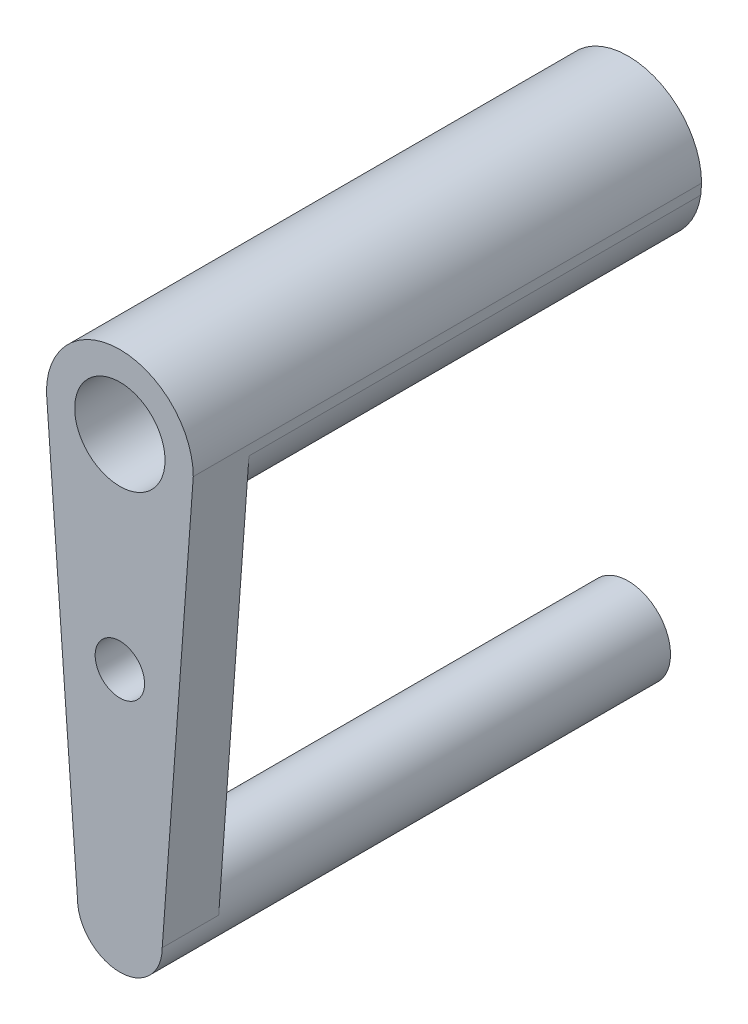
ISO-10303-21;
HEADER;
FILE_DESCRIPTION(('STEP AP214'),'2;1');
FILE_NAME('part.step','',(''),(''),'','','');
FILE_SCHEMA(('AUTOMOTIVE_DESIGN { 1 0 10303 214 1 1 1 1 }'));
ENDSEC;
DATA;
#1=APPLICATION_CONTEXT('core data for automotive mechanical design processes');
#2=APPLICATION_PROTOCOL_DEFINITION('international standard','automotive_design',2000,#1);
#3=PRODUCT_CONTEXT('',#1,'mechanical');
#4=PRODUCT('Part','Part','',(#3));
#5=PRODUCT_RELATED_PRODUCT_CATEGORY('part','',(#4));
#6=PRODUCT_DEFINITION_FORMATION('','',#4);
#7=PRODUCT_DEFINITION_CONTEXT('part definition',#1,'design');
#8=PRODUCT_DEFINITION('design','',#6,#7);
#9=PRODUCT_DEFINITION_SHAPE('','',#8);
#10=(LENGTH_UNIT() NAMED_UNIT(*) SI_UNIT(.MILLI.,.METRE.));
#11=(NAMED_UNIT(*) PLANE_ANGLE_UNIT() SI_UNIT($,.RADIAN.));
#12=(NAMED_UNIT(*) SI_UNIT($,.STERADIAN.) SOLID_ANGLE_UNIT());
#13=UNCERTAINTY_MEASURE_WITH_UNIT(LENGTH_MEASURE(1.E-05),#10,'distance_accuracy_value','');
#14=(GEOMETRIC_REPRESENTATION_CONTEXT(3) GLOBAL_UNCERTAINTY_ASSIGNED_CONTEXT((#13)) GLOBAL_UNIT_ASSIGNED_CONTEXT((#10,
#11,#12)) REPRESENTATION_CONTEXT('',''));
#15=CARTESIAN_POINT('',(0.,0.,0.));
#16=DIRECTION('',(0.,0.,1.));
#17=DIRECTION('',(1.,0.,0.));
#18=AXIS2_PLACEMENT_3D('',#15,#16,#17);
#19=CARTESIAN_POINT('',(0.,-30.,4.));
#20=DIRECTION('',(0.,0.,-1.));
#21=DIRECTION('',(-1.,0.,0.));
#22=AXIS2_PLACEMENT_3D('',#19,#20,#21);
#23=CYLINDRICAL_SURFACE('',#22,3.);
#24=DIRECTION('',(0.,0.,-1.));
#25=VECTOR('',#24,1.);
#26=CARTESIAN_POINT('',(-3.,-30.,4.));
#27=LINE('',#26,#25);
#28=CARTESIAN_POINT('',(-3.,-30.,4.));
#29=VERTEX_POINT('',#28);
#30=CARTESIAN_POINT('',(-3.,-30.,0.));
#31=VERTEX_POINT('',#30);
#32=EDGE_CURVE('E65',#29,#31,#27,.T.);
#33=ORIENTED_EDGE('',*,*,#32,.T.);
#34=CARTESIAN_POINT('',(0.,-30.,0.));
#35=DIRECTION('',(0.,0.,1.));
#36=DIRECTION('',(1.,0.,0.));
#37=AXIS2_PLACEMENT_3D('',#34,#35,#36);
#38=CIRCLE('',#37,3.);
#39=CARTESIAN_POINT('',(3.,-30.,0.));
#40=VERTEX_POINT('',#39);
#41=EDGE_CURVE('E78',#40,#31,#38,.T.);
#42=ORIENTED_EDGE('',*,*,#41,.F.);
#43=DIRECTION('',(0.,0.,-1.));
#44=VECTOR('',#43,1.);
#45=CARTESIAN_POINT('',(3.,-30.,4.));
#46=LINE('',#45,#44);
#47=CARTESIAN_POINT('',(3.,-30.,4.));
#48=VERTEX_POINT('',#47);
#49=EDGE_CURVE('E11',#48,#40,#46,.T.);
#50=ORIENTED_EDGE('',*,*,#49,.F.);
#51=CARTESIAN_POINT('',(0.,-30.,4.));
#52=DIRECTION('',(0.,0.,1.));
#53=DIRECTION('',(1.,0.,0.));
#54=AXIS2_PLACEMENT_3D('',#51,#52,#53);
#55=CIRCLE('',#54,3.);
#56=EDGE_CURVE('E123',#29,#48,#55,.T.);
#57=ORIENTED_EDGE('',*,*,#56,.F.);
#58=EDGE_LOOP('',(#33,#42,#50,#57));
#59=FACE_BOUND('',#58,.T.);
#60=CARTESIAN_POINT('',(0.,-30.,-32.));
#61=DIRECTION('',(0.,0.,1.));
#62=DIRECTION('',(1.,0.,0.));
#63=AXIS2_PLACEMENT_3D('',#60,#61,#62);
#64=CIRCLE('',#63,3.);
#65=CARTESIAN_POINT('',(3.,-30.,-32.));
#66=VERTEX_POINT('',#65);
#67=EDGE_CURVE('E176',#66,#66,#64,.T.);
#68=ORIENTED_EDGE('',*,*,#67,.T.);
#69=EDGE_LOOP('',(#68));
#70=FACE_BOUND('',#69,.T.);
#71=ADVANCED_FACE('F41',(#59,#70),#23,.T.);
#72=CARTESIAN_POINT('',(5.1721851377039,-0.379293576764953,4.));
#73=DIRECTION('',(0.9973219079214,-0.073136939914236,0.));
#74=DIRECTION('',(0.073136939914236,0.9973219079214,0.));
#75=AXIS2_PLACEMENT_3D('',#72,#73,#74);
#76=PLANE('',#75);
#77=DIRECTION('',(-0.073136939914236,-0.9973219079214,0.));
#78=VECTOR('',#77,1.);
#79=CARTESIAN_POINT('',(5.1721851377039,-0.379293576764953,0.));
#80=LINE('',#79,#78);
#81=CARTESIAN_POINT('',(5.14437027540781,-0.758587153529904,0.));
#82=VERTEX_POINT('',#81);
#83=EDGE_CURVE('E141',#82,#40,#80,.T.);
#84=ORIENTED_EDGE('',*,*,#83,.F.);
#85=DIRECTION('',(0.,0.,1.));
#86=VECTOR('',#85,1.);
#87=CARTESIAN_POINT('',(5.14437027540781,-0.758587153529904,-32.));
#88=LINE('',#87,#86);
#89=CARTESIAN_POINT('',(5.14437027540781,-0.758587153529904,-32.));
#90=VERTEX_POINT('',#89);
#91=EDGE_CURVE('E56',#90,#82,#88,.T.);
#92=ORIENTED_EDGE('',*,*,#91,.F.);
#93=DIRECTION('',(-0.073136939914236,-0.9973219079214,0.));
#94=VECTOR('',#93,1.);
#95=CARTESIAN_POINT('',(5.1721851377039,-0.379293576764953,-32.));
#96=LINE('',#95,#94);
#97=CARTESIAN_POINT('',(5.2,0.,-32.));
#98=VERTEX_POINT('',#97);
#99=EDGE_CURVE('E89',#98,#90,#96,.T.);
#100=ORIENTED_EDGE('',*,*,#99,.F.);
#101=DIRECTION('',(0.,0.,-1.));
#102=VECTOR('',#101,1.);
#103=CARTESIAN_POINT('',(5.2,0.,4.));
#104=LINE('',#103,#102);
#105=CARTESIAN_POINT('',(5.2,0.,4.));
#106=VERTEX_POINT('',#105);
#107=EDGE_CURVE('E49',#106,#98,#104,.T.);
#108=ORIENTED_EDGE('',*,*,#107,.F.);
#109=DIRECTION('',(-0.073136939914236,-0.9973219079214,0.));
#110=VECTOR('',#109,1.);
#111=CARTESIAN_POINT('',(5.1721851377039,-0.379293576764953,4.));
#112=LINE('',#111,#110);
#113=EDGE_CURVE('E107',#106,#48,#112,.T.);
#114=ORIENTED_EDGE('',*,*,#113,.T.);
#115=ORIENTED_EDGE('',*,*,#49,.T.);
#116=EDGE_LOOP('',(#84,#92,#100,#108,#114,#115));
#117=FACE_BOUND('',#116,.T.);
#118=ADVANCED_FACE('F105',(#117),#76,.T.);
#119=CARTESIAN_POINT('',(0.,0.,4.));
#120=DIRECTION('',(0.,0.,-1.));
#121=DIRECTION('',(-1.,0.,0.));
#122=AXIS2_PLACEMENT_3D('',#119,#120,#121);
#123=CYLINDRICAL_SURFACE('',#122,5.2);
#124=ORIENTED_EDGE('',*,*,#107,.T.);
#125=CARTESIAN_POINT('',(0.,0.,-32.));
#126=DIRECTION('',(0.,0.,1.));
#127=DIRECTION('',(1.,0.,0.));
#128=AXIS2_PLACEMENT_3D('',#125,#126,#127);
#129=CIRCLE('',#128,5.2);
#130=CARTESIAN_POINT('',(-5.2,0.,-32.));
#131=VERTEX_POINT('',#130);
#132=EDGE_CURVE('E159',#98,#131,#129,.T.);
#133=ORIENTED_EDGE('',*,*,#132,.T.);
#134=DIRECTION('',(0.,0.,-1.));
#135=VECTOR('',#134,1.);
#136=CARTESIAN_POINT('',(-5.2,0.,4.));
#137=LINE('',#136,#135);
#138=CARTESIAN_POINT('',(-5.2,0.,4.));
#139=VERTEX_POINT('',#138);
#140=EDGE_CURVE('E111',#139,#131,#137,.T.);
#141=ORIENTED_EDGE('',*,*,#140,.F.);
#142=CARTESIAN_POINT('',(0.,0.,4.));
#143=DIRECTION('',(0.,0.,1.));
#144=DIRECTION('',(1.,0.,0.));
#145=AXIS2_PLACEMENT_3D('',#142,#143,#144);
#146=CIRCLE('',#145,5.2);
#147=EDGE_CURVE('E113',#106,#139,#146,.T.);
#148=ORIENTED_EDGE('',*,*,#147,.F.);
#149=EDGE_LOOP('',(#124,#133,#141,#148));
#150=FACE_BOUND('',#149,.T.);
#151=ADVANCED_FACE('F114',(#150),#123,.T.);
#152=CARTESIAN_POINT('',(0.,-14.4303895344304,4.));
#153=DIRECTION('',(0.,0.,-1.));
#154=DIRECTION('',(-1.,0.,0.));
#155=AXIS2_PLACEMENT_3D('',#152,#153,#154);
#156=CYLINDRICAL_SURFACE('',#155,1.75);
#157=CARTESIAN_POINT('',(0.,-14.4303895344304,4.));
#158=DIRECTION('',(0.,0.,1.));
#159=DIRECTION('',(1.,0.,0.));
#160=AXIS2_PLACEMENT_3D('',#157,#158,#159);
#161=CIRCLE('',#160,1.75);
#162=CARTESIAN_POINT('',(1.75,-14.4303895344304,4.));
#163=VERTEX_POINT('',#162);
#164=EDGE_CURVE('E133',#163,#163,#161,.T.);
#165=ORIENTED_EDGE('',*,*,#164,.T.);
#166=EDGE_LOOP('',(#165));
#167=FACE_BOUND('',#166,.T.);
#168=CARTESIAN_POINT('',(0.,-14.4303895344304,0.));
#169=DIRECTION('',(0.,0.,1.));
#170=DIRECTION('',(1.,0.,0.));
#171=AXIS2_PLACEMENT_3D('',#168,#169,#170);
#172=CIRCLE('',#171,1.75);
#173=CARTESIAN_POINT('',(1.75,-14.4303895344304,0.));
#174=VERTEX_POINT('',#173);
#175=EDGE_CURVE('E127',#174,#174,#172,.T.);
#176=ORIENTED_EDGE('',*,*,#175,.F.);
#177=EDGE_LOOP('',(#176));
#178=FACE_BOUND('',#177,.T.);
#179=ADVANCED_FACE('F198',(#167,#178),#156,.F.);
#180=CARTESIAN_POINT('',(-5.1721851377039,-0.379293576764953,4.));
#181=DIRECTION('',(-0.9973219079214,-0.073136939914236,0.));
#182=DIRECTION('',(0.073136939914236,-0.9973219079214,0.));
#183=AXIS2_PLACEMENT_3D('',#180,#181,#182);
#184=PLANE('',#183);
#185=DIRECTION('',(-0.073136939914236,0.9973219079214,0.));
#186=VECTOR('',#185,1.);
#187=CARTESIAN_POINT('',(-5.1721851377039,-0.379293576764953,0.));
#188=LINE('',#187,#186);
#189=CARTESIAN_POINT('',(-5.14437027540781,-0.758587153529904,0.));
#190=VERTEX_POINT('',#189);
#191=EDGE_CURVE('E144',#31,#190,#188,.T.);
#192=ORIENTED_EDGE('',*,*,#191,.F.);
#193=ORIENTED_EDGE('',*,*,#32,.F.);
#194=DIRECTION('',(-0.073136939914236,0.9973219079214,0.));
#195=VECTOR('',#194,1.);
#196=CARTESIAN_POINT('',(-5.1721851377039,-0.379293576764953,4.));
#197=LINE('',#196,#195);
#198=EDGE_CURVE('E119',#29,#139,#197,.T.);
#199=ORIENTED_EDGE('',*,*,#198,.T.);
#200=ORIENTED_EDGE('',*,*,#140,.T.);
#201=DIRECTION('',(-0.073136939914236,0.9973219079214,0.));
#202=VECTOR('',#201,1.);
#203=CARTESIAN_POINT('',(-5.1721851377039,-0.379293576764953,-32.));
#204=LINE('',#203,#202);
#205=CARTESIAN_POINT('',(-5.14437027540781,-0.758587153529904,-32.));
#206=VERTEX_POINT('',#205);
#207=EDGE_CURVE('E157',#206,#131,#204,.T.);
#208=ORIENTED_EDGE('',*,*,#207,.F.);
#209=DIRECTION('',(0.,0.,1.));
#210=VECTOR('',#209,1.);
#211=CARTESIAN_POINT('',(-5.14437027540781,-0.758587153529904,-32.));
#212=LINE('',#211,#210);
#213=EDGE_CURVE('E169',#206,#190,#212,.T.);
#214=ORIENTED_EDGE('',*,*,#213,.T.);
#215=EDGE_LOOP('',(#192,#193,#199,#200,#208,#214));
#216=FACE_BOUND('',#215,.T.);
#217=ADVANCED_FACE('F156',(#216),#184,.T.);
#218=CARTESIAN_POINT('',(0.,0.,4.));
#219=DIRECTION('',(0.,0.,-1.));
#220=DIRECTION('',(-1.,0.,0.));
#221=AXIS2_PLACEMENT_3D('',#218,#219,#220);
#222=CYLINDRICAL_SURFACE('',#221,3.2);
#223=CARTESIAN_POINT('',(0.,0.,4.));
#224=DIRECTION('',(0.,0.,1.));
#225=DIRECTION('',(1.,0.,0.));
#226=AXIS2_PLACEMENT_3D('',#223,#224,#225);
#227=CIRCLE('',#226,3.2);
#228=CARTESIAN_POINT('',(3.2,0.,4.));
#229=VERTEX_POINT('',#228);
#230=EDGE_CURVE('E137',#229,#229,#227,.T.);
#231=ORIENTED_EDGE('',*,*,#230,.T.);
#232=EDGE_LOOP('',(#231));
#233=FACE_BOUND('',#232,.T.);
#234=CARTESIAN_POINT('',(0.,0.,-32.));
#235=DIRECTION('',(0.,0.,1.));
#236=DIRECTION('',(1.,0.,0.));
#237=AXIS2_PLACEMENT_3D('',#234,#235,#236);
#238=CIRCLE('',#237,3.2);
#239=CARTESIAN_POINT('',(3.2,0.,-32.));
#240=VERTEX_POINT('',#239);
#241=EDGE_CURVE('E166',#240,#240,#238,.T.);
#242=ORIENTED_EDGE('',*,*,#241,.F.);
#243=EDGE_LOOP('',(#242));
#244=FACE_BOUND('',#243,.T.);
#245=ADVANCED_FACE('F203',(#233,#244),#222,.F.);
#246=CARTESIAN_POINT('',(0.,0.,4.));
#247=DIRECTION('',(0.,0.,1.));
#248=DIRECTION('',(1.,0.,0.));
#249=AXIS2_PLACEMENT_3D('',#246,#247,#248);
#250=PLANE('',#249);
#251=ORIENTED_EDGE('',*,*,#56,.T.);
#252=ORIENTED_EDGE('',*,*,#113,.F.);
#253=ORIENTED_EDGE('',*,*,#147,.T.);
#254=ORIENTED_EDGE('',*,*,#198,.F.);
#255=EDGE_LOOP('',(#251,#252,#253,#254));
#256=FACE_BOUND('',#255,.T.);
#257=ORIENTED_EDGE('',*,*,#164,.F.);
#258=EDGE_LOOP('',(#257));
#259=FACE_BOUND('',#258,.T.);
#260=ORIENTED_EDGE('',*,*,#230,.F.);
#261=EDGE_LOOP('',(#260));
#262=FACE_BOUND('',#261,.T.);
#263=ADVANCED_FACE('F121',(#256,#259,#262),#250,.T.);
#264=CARTESIAN_POINT('',(0.,0.,0.));
#265=DIRECTION('',(0.,0.,1.));
#266=DIRECTION('',(1.,0.,0.));
#267=AXIS2_PLACEMENT_3D('',#264,#265,#266);
#268=PLANE('',#267);
#269=ORIENTED_EDGE('',*,*,#83,.T.);
#270=ORIENTED_EDGE('',*,*,#41,.T.);
#271=ORIENTED_EDGE('',*,*,#191,.T.);
#272=CARTESIAN_POINT('',(0.,0.,0.));
#273=DIRECTION('',(0.,0.,1.));
#274=DIRECTION('',(1.,0.,0.));
#275=AXIS2_PLACEMENT_3D('',#272,#273,#274);
#276=CIRCLE('',#275,5.2);
#277=EDGE_CURVE('E174',#190,#82,#276,.T.);
#278=ORIENTED_EDGE('',*,*,#277,.T.);
#279=EDGE_LOOP('',(#269,#270,#271,#278));
#280=FACE_BOUND('',#279,.T.);
#281=ORIENTED_EDGE('',*,*,#175,.T.);
#282=EDGE_LOOP('',(#281));
#283=FACE_BOUND('',#282,.T.);
#284=ADVANCED_FACE('F188',(#280,#283),#268,.F.);
#285=CARTESIAN_POINT('',(0.,0.,-32.));
#286=DIRECTION('',(0.,0.,1.));
#287=DIRECTION('',(1.,0.,0.));
#288=AXIS2_PLACEMENT_3D('',#285,#286,#287);
#289=CYLINDRICAL_SURFACE('',#288,5.2);
#290=ORIENTED_EDGE('',*,*,#277,.F.);
#291=ORIENTED_EDGE('',*,*,#213,.F.);
#292=EDGE_CURVE('E160',#206,#90,#129,.T.);
#293=ORIENTED_EDGE('',*,*,#292,.T.);
#294=ORIENTED_EDGE('',*,*,#91,.T.);
#295=EDGE_LOOP('',(#290,#291,#293,#294));
#296=FACE_BOUND('',#295,.T.);
#297=ADVANCED_FACE('F212',(#296),#289,.T.);
#298=CARTESIAN_POINT('',(0.,0.,-32.));
#299=DIRECTION('',(0.,0.,1.));
#300=DIRECTION('',(1.,0.,0.));
#301=AXIS2_PLACEMENT_3D('',#298,#299,#300);
#302=PLANE('',#301);
#303=ORIENTED_EDGE('',*,*,#241,.T.);
#304=EDGE_LOOP('',(#303));
#305=FACE_BOUND('',#304,.T.);
#306=ORIENTED_EDGE('',*,*,#99,.T.);
#307=ORIENTED_EDGE('',*,*,#292,.F.);
#308=ORIENTED_EDGE('',*,*,#207,.T.);
#309=ORIENTED_EDGE('',*,*,#132,.F.);
#310=EDGE_LOOP('',(#306,#307,#308,#309));
#311=FACE_BOUND('',#310,.T.);
#312=ADVANCED_FACE('F158',(#305,#311),#302,.F.);
#313=CARTESIAN_POINT('',(0.,0.,-32.));
#314=DIRECTION('',(0.,0.,1.));
#315=DIRECTION('',(1.,0.,0.));
#316=AXIS2_PLACEMENT_3D('',#313,#314,#315);
#317=PLANE('',#316);
#318=ORIENTED_EDGE('',*,*,#67,.F.);
#319=EDGE_LOOP('',(#318));
#320=FACE_BOUND('',#319,.T.);
#321=ADVANCED_FACE('F219',(#320),#317,.F.);
#322=CLOSED_SHELL('',(#71,#118,#151,#179,#217,#245,#263,#284,#297,#312,#321));
#323=MANIFOLD_SOLID_BREP('B2',#322);
#324=ADVANCED_BREP_SHAPE_REPRESENTATION('',(#18,#323),#14);
#325=SHAPE_DEFINITION_REPRESENTATION(#9,#324);
ENDSEC;
END-ISO-10303-21;
